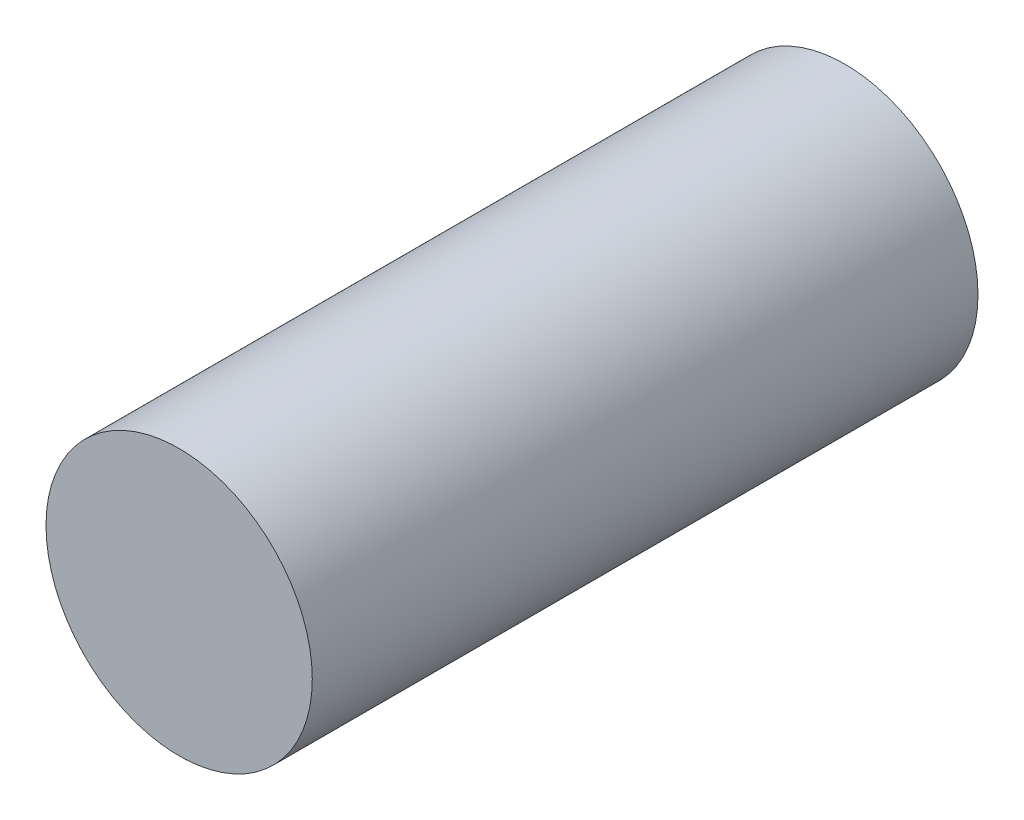
ISO-10303-21;
HEADER;
FILE_DESCRIPTION(('STEP AP214'),'2;1');
FILE_NAME('part.step','',(''),(''),'','','');
FILE_SCHEMA(('AUTOMOTIVE_DESIGN { 1 0 10303 214 1 1 1 1 }'));
ENDSEC;
DATA;
#1=APPLICATION_CONTEXT('core data for automotive mechanical design processes');
#2=APPLICATION_PROTOCOL_DEFINITION('international standard','automotive_design',2000,#1);
#3=PRODUCT_CONTEXT('',#1,'mechanical');
#4=PRODUCT('Part','Part','',(#3));
#5=PRODUCT_RELATED_PRODUCT_CATEGORY('part','',(#4));
#6=PRODUCT_DEFINITION_FORMATION('','',#4);
#7=PRODUCT_DEFINITION_CONTEXT('part definition',#1,'design');
#8=PRODUCT_DEFINITION('design','',#6,#7);
#9=PRODUCT_DEFINITION_SHAPE('','',#8);
#10=(LENGTH_UNIT() NAMED_UNIT(*) SI_UNIT(.MILLI.,.METRE.));
#11=(NAMED_UNIT(*) PLANE_ANGLE_UNIT() SI_UNIT($,.RADIAN.));
#12=(NAMED_UNIT(*) SI_UNIT($,.STERADIAN.) SOLID_ANGLE_UNIT());
#13=UNCERTAINTY_MEASURE_WITH_UNIT(LENGTH_MEASURE(1.E-05),#10,'distance_accuracy_value','');
#14=(GEOMETRIC_REPRESENTATION_CONTEXT(3) GLOBAL_UNCERTAINTY_ASSIGNED_CONTEXT((#13)) GLOBAL_UNIT_ASSIGNED_CONTEXT((#10,
#11,#12)) REPRESENTATION_CONTEXT('',''));
#15=CARTESIAN_POINT('',(0.,0.,0.));
#16=DIRECTION('',(0.,0.,1.));
#17=DIRECTION('',(1.,0.,0.));
#18=AXIS2_PLACEMENT_3D('',#15,#16,#17);
#19=CARTESIAN_POINT('',(-4.52673085521837,-2.18590365875571,20.));
#20=DIRECTION('',(0.,0.,-1.));
#21=DIRECTION('',(-1.,0.,0.));
#22=AXIS2_PLACEMENT_3D('',#19,#20,#21);
#23=CYLINDRICAL_SURFACE('',#22,4.);
#24=CARTESIAN_POINT('',(-4.52673085521837,-2.18590365875571,20.));
#25=DIRECTION('',(0.,0.,1.));
#26=DIRECTION('',(1.,0.,0.));
#27=AXIS2_PLACEMENT_3D('',#24,#25,#26);
#28=CIRCLE('',#27,4.);
#29=CARTESIAN_POINT('',(-0.526730855218375,-2.18590365875571,20.));
#30=VERTEX_POINT('',#29);
#31=EDGE_CURVE('E10',#30,#30,#28,.T.);
#32=ORIENTED_EDGE('',*,*,#31,.F.);
#33=EDGE_LOOP('',(#32));
#34=FACE_BOUND('',#33,.T.);
#35=CARTESIAN_POINT('',(-4.52673085521837,-2.18590365875571,0.));
#36=DIRECTION('',(0.,0.,1.));
#37=DIRECTION('',(1.,0.,0.));
#38=AXIS2_PLACEMENT_3D('',#35,#36,#37);
#39=CIRCLE('',#38,4.);
#40=CARTESIAN_POINT('',(-0.526730855218375,-2.18590365875571,0.));
#41=VERTEX_POINT('',#40);
#42=EDGE_CURVE('E40',#41,#41,#39,.T.);
#43=ORIENTED_EDGE('',*,*,#42,.T.);
#44=EDGE_LOOP('',(#43));
#45=FACE_BOUND('',#44,.T.);
#46=ADVANCED_FACE('F37',(#34,#45),#23,.T.);
#47=CARTESIAN_POINT('',(-4.52673085521837,-2.18590365875571,20.));
#48=DIRECTION('',(0.,0.,1.));
#49=DIRECTION('',(1.,0.,0.));
#50=AXIS2_PLACEMENT_3D('',#47,#48,#49);
#51=PLANE('',#50);
#52=ORIENTED_EDGE('',*,*,#31,.T.);
#53=EDGE_LOOP('',(#52));
#54=FACE_BOUND('',#53,.T.);
#55=ADVANCED_FACE('F70',(#54),#51,.T.);
#56=CARTESIAN_POINT('',(-4.52673085521837,-2.18590365875571,0.));
#57=DIRECTION('',(0.,0.,1.));
#58=DIRECTION('',(1.,0.,0.));
#59=AXIS2_PLACEMENT_3D('',#56,#57,#58);
#60=PLANE('',#59);
#61=CARTESIAN_POINT('',(-4.88005562411331,-2.04071034582398,0.));
#62=DIRECTION('',(0.,0.,-1.));
#63=DIRECTION('',(-1.,0.,0.));
#64=AXIS2_PLACEMENT_3D('',#61,#62,#63);
#65=CIRCLE('',#64,1.5);
#66=CARTESIAN_POINT('',(-6.38005562411331,-2.04071034582398,0.));
#67=VERTEX_POINT('',#66);
#68=EDGE_CURVE('E51',#67,#67,#65,.T.);
#69=ORIENTED_EDGE('',*,*,#68,.F.);
#70=EDGE_LOOP('',(#69));
#71=FACE_BOUND('',#70,.T.);
#72=ORIENTED_EDGE('',*,*,#42,.F.);
#73=EDGE_LOOP('',(#72));
#74=FACE_BOUND('',#73,.T.);
#75=ADVANCED_FACE('F64',(#71,#74),#60,.F.);
#76=CARTESIAN_POINT('',(-4.88005562411331,-2.04071034582398,3.));
#77=DIRECTION('',(0.,0.,-1.));
#78=DIRECTION('',(-1.,0.,0.));
#79=AXIS2_PLACEMENT_3D('',#76,#77,#78);
#80=CYLINDRICAL_SURFACE('',#79,1.5);
#81=CARTESIAN_POINT('',(-4.88005562411331,-2.04071034582398,3.));
#82=DIRECTION('',(0.,0.,-1.));
#83=DIRECTION('',(-1.,0.,0.));
#84=AXIS2_PLACEMENT_3D('',#81,#82,#83);
#85=CIRCLE('',#84,1.5);
#86=CARTESIAN_POINT('',(-6.38005562411331,-2.04071034582398,3.));
#87=VERTEX_POINT('',#86);
#88=EDGE_CURVE('E49',#87,#87,#85,.T.);
#89=ORIENTED_EDGE('',*,*,#88,.F.);
#90=EDGE_LOOP('',(#89));
#91=FACE_BOUND('',#90,.T.);
#92=ORIENTED_EDGE('',*,*,#68,.T.);
#93=EDGE_LOOP('',(#92));
#94=FACE_BOUND('',#93,.T.);
#95=ADVANCED_FACE('F61',(#91,#94),#80,.F.);
#96=CARTESIAN_POINT('',(-4.88005562411331,-2.04071034582398,3.));
#97=DIRECTION('',(0.,0.,-1.));
#98=DIRECTION('',(-1.,0.,0.));
#99=AXIS2_PLACEMENT_3D('',#96,#97,#98);
#100=PLANE('',#99);
#101=ORIENTED_EDGE('',*,*,#88,.T.);
#102=EDGE_LOOP('',(#101));
#103=FACE_BOUND('',#102,.T.);
#104=ADVANCED_FACE('F59',(#103),#100,.T.);
#105=CLOSED_SHELL('',(#46,#55,#75,#95,#104));
#106=MANIFOLD_SOLID_BREP('B2',#105);
#107=ADVANCED_BREP_SHAPE_REPRESENTATION('',(#18,#106),#14);
#108=SHAPE_DEFINITION_REPRESENTATION(#9,#107);
ENDSEC;
END-ISO-10303-21;
